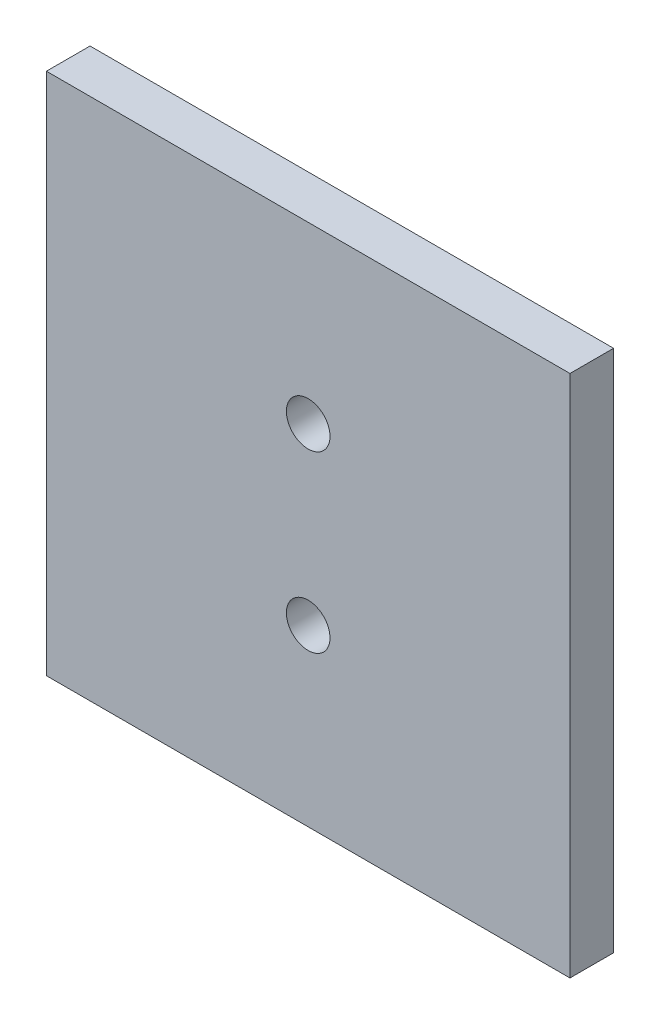
ISO-10303-21;
HEADER;
FILE_DESCRIPTION(('STEP AP214'),'2;1');
FILE_NAME('part.step','',(''),(''),'','','');
FILE_SCHEMA(('AUTOMOTIVE_DESIGN { 1 0 10303 214 1 1 1 1 }'));
ENDSEC;
DATA;
#1=APPLICATION_CONTEXT('core data for automotive mechanical design processes');
#2=APPLICATION_PROTOCOL_DEFINITION('international standard','automotive_design',2000,#1);
#3=PRODUCT_CONTEXT('',#1,'mechanical');
#4=PRODUCT('Part','Part','',(#3));
#5=PRODUCT_RELATED_PRODUCT_CATEGORY('part','',(#4));
#6=PRODUCT_DEFINITION_FORMATION('','',#4);
#7=PRODUCT_DEFINITION_CONTEXT('part definition',#1,'design');
#8=PRODUCT_DEFINITION('design','',#6,#7);
#9=PRODUCT_DEFINITION_SHAPE('','',#8);
#10=(LENGTH_UNIT() NAMED_UNIT(*) SI_UNIT(.MILLI.,.METRE.));
#11=(NAMED_UNIT(*) PLANE_ANGLE_UNIT() SI_UNIT($,.RADIAN.));
#12=(NAMED_UNIT(*) SI_UNIT($,.STERADIAN.) SOLID_ANGLE_UNIT());
#13=UNCERTAINTY_MEASURE_WITH_UNIT(LENGTH_MEASURE(1.E-05),#10,'distance_accuracy_value','');
#14=(GEOMETRIC_REPRESENTATION_CONTEXT(3) GLOBAL_UNCERTAINTY_ASSIGNED_CONTEXT((#13)) GLOBAL_UNIT_ASSIGNED_CONTEXT((#10,
#11,#12)) REPRESENTATION_CONTEXT('',''));
#15=CARTESIAN_POINT('',(0.,0.,0.));
#16=DIRECTION('',(0.,0.,1.));
#17=DIRECTION('',(1.,0.,0.));
#18=AXIS2_PLACEMENT_3D('',#15,#16,#17);
#19=CARTESIAN_POINT('',(0.,76.2,6.35));
#20=DIRECTION('',(0.,0.,-1.));
#21=DIRECTION('',(-1.,0.,0.));
#22=AXIS2_PLACEMENT_3D('',#19,#20,#21);
#23=PLANE('',#22);
#24=CARTESIAN_POINT('',(38.1,50.8,6.35));
#25=DIRECTION('',(0.,0.,1.));
#26=DIRECTION('',(1.,0.,0.));
#27=AXIS2_PLACEMENT_3D('',#24,#25,#26);
#28=CIRCLE('',#27,3.175);
#29=CARTESIAN_POINT('',(41.275,50.8,6.35));
#30=VERTEX_POINT('',#29);
#31=EDGE_CURVE('E100',#30,#30,#28,.T.);
#32=ORIENTED_EDGE('',*,*,#31,.F.);
#33=EDGE_LOOP('',(#32));
#34=FACE_BOUND('',#33,.T.);
#35=DIRECTION('',(0.,-1.,0.));
#36=VECTOR('',#35,1.);
#37=CARTESIAN_POINT('',(0.,0.,6.35));
#38=LINE('',#37,#36);
#39=CARTESIAN_POINT('',(0.,76.2,6.35));
#40=VERTEX_POINT('',#39);
#41=CARTESIAN_POINT('',(0.,0.,6.35));
#42=VERTEX_POINT('',#41);
#43=EDGE_CURVE('E85',#40,#42,#38,.T.);
#44=ORIENTED_EDGE('',*,*,#43,.T.);
#45=DIRECTION('',(1.,0.,0.));
#46=VECTOR('',#45,1.);
#47=CARTESIAN_POINT('',(0.,0.,6.35));
#48=LINE('',#47,#46);
#49=CARTESIAN_POINT('',(76.2,0.,6.35));
#50=VERTEX_POINT('',#49);
#51=EDGE_CURVE('E80',#42,#50,#48,.T.);
#52=ORIENTED_EDGE('',*,*,#51,.T.);
#53=DIRECTION('',(0.,1.,0.));
#54=VECTOR('',#53,1.);
#55=CARTESIAN_POINT('',(76.2,0.,6.35));
#56=LINE('',#55,#54);
#57=CARTESIAN_POINT('',(76.2,76.2,6.35));
#58=VERTEX_POINT('',#57);
#59=EDGE_CURVE('E83',#50,#58,#56,.T.);
#60=ORIENTED_EDGE('',*,*,#59,.T.);
#61=DIRECTION('',(-1.,0.,0.));
#62=VECTOR('',#61,1.);
#63=CARTESIAN_POINT('',(0.,76.2,6.35));
#64=LINE('',#63,#62);
#65=EDGE_CURVE('E50',#58,#40,#64,.T.);
#66=ORIENTED_EDGE('',*,*,#65,.T.);
#67=EDGE_LOOP('',(#44,#52,#60,#66));
#68=FACE_BOUND('',#67,.T.);
#69=CARTESIAN_POINT('',(38.1,25.4,6.35));
#70=DIRECTION('',(0.,0.,1.));
#71=DIRECTION('',(-1.,0.,0.));
#72=AXIS2_PLACEMENT_3D('',#69,#70,#71);
#73=CIRCLE('',#72,3.175);
#74=CARTESIAN_POINT('',(34.925,25.4,6.35));
#75=VERTEX_POINT('',#74);
#76=EDGE_CURVE('E115',#75,#75,#73,.T.);
#77=ORIENTED_EDGE('',*,*,#76,.F.);
#78=EDGE_LOOP('',(#77));
#79=FACE_BOUND('',#78,.T.);
#80=ADVANCED_FACE('F33',(#34,#68,#79),#23,.F.);
#81=CARTESIAN_POINT('',(0.,76.2,0.));
#82=DIRECTION('',(0.,0.,-1.));
#83=DIRECTION('',(-1.,0.,0.));
#84=AXIS2_PLACEMENT_3D('',#81,#82,#83);
#85=PLANE('',#84);
#86=CARTESIAN_POINT('',(38.1,50.8,0.));
#87=DIRECTION('',(0.,0.,1.));
#88=DIRECTION('',(1.,0.,0.));
#89=AXIS2_PLACEMENT_3D('',#86,#87,#88);
#90=CIRCLE('',#89,3.175);
#91=CARTESIAN_POINT('',(41.275,50.8,0.));
#92=VERTEX_POINT('',#91);
#93=EDGE_CURVE('E112',#92,#92,#90,.T.);
#94=ORIENTED_EDGE('',*,*,#93,.T.);
#95=EDGE_LOOP('',(#94));
#96=FACE_BOUND('',#95,.T.);
#97=DIRECTION('',(0.,-1.,0.));
#98=VECTOR('',#97,1.);
#99=CARTESIAN_POINT('',(0.,0.,0.));
#100=LINE('',#99,#98);
#101=CARTESIAN_POINT('',(0.,76.2,0.));
#102=VERTEX_POINT('',#101);
#103=CARTESIAN_POINT('',(0.,0.,0.));
#104=VERTEX_POINT('',#103);
#105=EDGE_CURVE('E97',#102,#104,#100,.T.);
#106=ORIENTED_EDGE('',*,*,#105,.F.);
#107=DIRECTION('',(-1.,0.,0.));
#108=VECTOR('',#107,1.);
#109=CARTESIAN_POINT('',(0.,76.2,0.));
#110=LINE('',#109,#108);
#111=CARTESIAN_POINT('',(76.2,76.2,0.));
#112=VERTEX_POINT('',#111);
#113=EDGE_CURVE('E73',#112,#102,#110,.T.);
#114=ORIENTED_EDGE('',*,*,#113,.F.);
#115=DIRECTION('',(0.,1.,0.));
#116=VECTOR('',#115,1.);
#117=CARTESIAN_POINT('',(76.2,0.,0.));
#118=LINE('',#117,#116);
#119=CARTESIAN_POINT('',(76.2,0.,0.));
#120=VERTEX_POINT('',#119);
#121=EDGE_CURVE('E67',#120,#112,#118,.T.);
#122=ORIENTED_EDGE('',*,*,#121,.F.);
#123=DIRECTION('',(1.,0.,0.));
#124=VECTOR('',#123,1.);
#125=CARTESIAN_POINT('',(0.,0.,0.));
#126=LINE('',#125,#124);
#127=EDGE_CURVE('E89',#104,#120,#126,.T.);
#128=ORIENTED_EDGE('',*,*,#127,.F.);
#129=EDGE_LOOP('',(#106,#114,#122,#128));
#130=FACE_BOUND('',#129,.T.);
#131=CARTESIAN_POINT('',(38.1,25.4,0.));
#132=DIRECTION('',(0.,0.,1.));
#133=DIRECTION('',(-1.,0.,0.));
#134=AXIS2_PLACEMENT_3D('',#131,#132,#133);
#135=CIRCLE('',#134,3.175);
#136=CARTESIAN_POINT('',(34.925,25.4,0.));
#137=VERTEX_POINT('',#136);
#138=EDGE_CURVE('E118',#137,#137,#135,.T.);
#139=ORIENTED_EDGE('',*,*,#138,.T.);
#140=EDGE_LOOP('',(#139));
#141=FACE_BOUND('',#140,.T.);
#142=ADVANCED_FACE('F108',(#96,#130,#141),#85,.T.);
#143=CARTESIAN_POINT('',(0.,0.,6.35));
#144=DIRECTION('',(1.,0.,0.));
#145=DIRECTION('',(0.,0.,-1.));
#146=AXIS2_PLACEMENT_3D('',#143,#144,#145);
#147=PLANE('',#146);
#148=ORIENTED_EDGE('',*,*,#105,.T.);
#149=DIRECTION('',(0.,0.,-1.));
#150=VECTOR('',#149,1.);
#151=CARTESIAN_POINT('',(0.,0.,6.35));
#152=LINE('',#151,#150);
#153=EDGE_CURVE('E11',#42,#104,#152,.T.);
#154=ORIENTED_EDGE('',*,*,#153,.F.);
#155=ORIENTED_EDGE('',*,*,#43,.F.);
#156=DIRECTION('',(0.,0.,-1.));
#157=VECTOR('',#156,1.);
#158=CARTESIAN_POINT('',(0.,76.2,6.35));
#159=LINE('',#158,#157);
#160=EDGE_CURVE('E93',#40,#102,#159,.T.);
#161=ORIENTED_EDGE('',*,*,#160,.T.);
#162=EDGE_LOOP('',(#148,#154,#155,#161));
#163=FACE_BOUND('',#162,.T.);
#164=ADVANCED_FACE('F35',(#163),#147,.F.);
#165=CARTESIAN_POINT('',(0.,0.,6.35));
#166=DIRECTION('',(0.,1.,0.));
#167=DIRECTION('',(0.,0.,1.));
#168=AXIS2_PLACEMENT_3D('',#165,#166,#167);
#169=PLANE('',#168);
#170=ORIENTED_EDGE('',*,*,#127,.T.);
#171=DIRECTION('',(0.,0.,-1.));
#172=VECTOR('',#171,1.);
#173=CARTESIAN_POINT('',(76.2,0.,6.35));
#174=LINE('',#173,#172);
#175=EDGE_CURVE('E42',#50,#120,#174,.T.);
#176=ORIENTED_EDGE('',*,*,#175,.F.);
#177=ORIENTED_EDGE('',*,*,#51,.F.);
#178=ORIENTED_EDGE('',*,*,#153,.T.);
#179=EDGE_LOOP('',(#170,#176,#177,#178));
#180=FACE_BOUND('',#179,.T.);
#181=ADVANCED_FACE('F88',(#180),#169,.F.);
#182=CARTESIAN_POINT('',(76.2,0.,6.35));
#183=DIRECTION('',(-1.,0.,0.));
#184=DIRECTION('',(0.,0.,1.));
#185=AXIS2_PLACEMENT_3D('',#182,#183,#184);
#186=PLANE('',#185);
#187=ORIENTED_EDGE('',*,*,#121,.T.);
#188=DIRECTION('',(0.,0.,-1.));
#189=VECTOR('',#188,1.);
#190=CARTESIAN_POINT('',(76.2,76.2,6.35));
#191=LINE('',#190,#189);
#192=EDGE_CURVE('E90',#58,#112,#191,.T.);
#193=ORIENTED_EDGE('',*,*,#192,.F.);
#194=ORIENTED_EDGE('',*,*,#59,.F.);
#195=ORIENTED_EDGE('',*,*,#175,.T.);
#196=EDGE_LOOP('',(#187,#193,#194,#195));
#197=FACE_BOUND('',#196,.T.);
#198=ADVANCED_FACE('F91',(#197),#186,.F.);
#199=CARTESIAN_POINT('',(0.,76.2,6.35));
#200=DIRECTION('',(0.,-1.,0.));
#201=DIRECTION('',(0.,0.,-1.));
#202=AXIS2_PLACEMENT_3D('',#199,#200,#201);
#203=PLANE('',#202);
#204=ORIENTED_EDGE('',*,*,#113,.T.);
#205=ORIENTED_EDGE('',*,*,#160,.F.);
#206=ORIENTED_EDGE('',*,*,#65,.F.);
#207=ORIENTED_EDGE('',*,*,#192,.T.);
#208=EDGE_LOOP('',(#204,#205,#206,#207));
#209=FACE_BOUND('',#208,.T.);
#210=ADVANCED_FACE('F105',(#209),#203,.F.);
#211=CARTESIAN_POINT('',(38.1,50.8,6.35));
#212=DIRECTION('',(0.,0.,-1.));
#213=DIRECTION('',(-1.,0.,0.));
#214=AXIS2_PLACEMENT_3D('',#211,#212,#213);
#215=CYLINDRICAL_SURFACE('',#214,3.175);
#216=ORIENTED_EDGE('',*,*,#31,.T.);
#217=EDGE_LOOP('',(#216));
#218=FACE_BOUND('',#217,.T.);
#219=ORIENTED_EDGE('',*,*,#93,.F.);
#220=EDGE_LOOP('',(#219));
#221=FACE_BOUND('',#220,.T.);
#222=ADVANCED_FACE('F136',(#218,#221),#215,.F.);
#223=CARTESIAN_POINT('',(38.1,25.4,6.35));
#224=DIRECTION('',(0.,0.,-1.));
#225=DIRECTION('',(-1.,0.,0.));
#226=AXIS2_PLACEMENT_3D('',#223,#224,#225);
#227=CYLINDRICAL_SURFACE('',#226,3.175);
#228=ORIENTED_EDGE('',*,*,#76,.T.);
#229=EDGE_LOOP('',(#228));
#230=FACE_BOUND('',#229,.T.);
#231=ORIENTED_EDGE('',*,*,#138,.F.);
#232=EDGE_LOOP('',(#231));
#233=FACE_BOUND('',#232,.T.);
#234=ADVANCED_FACE('F124',(#230,#233),#227,.F.);
#235=CLOSED_SHELL('',(#80,#142,#164,#181,#198,#210,#222,#234));
#236=MANIFOLD_SOLID_BREP('B2',#235);
#237=ADVANCED_BREP_SHAPE_REPRESENTATION('',(#18,#236),#14);
#238=SHAPE_DEFINITION_REPRESENTATION(#9,#237);
ENDSEC;
END-ISO-10303-21;
